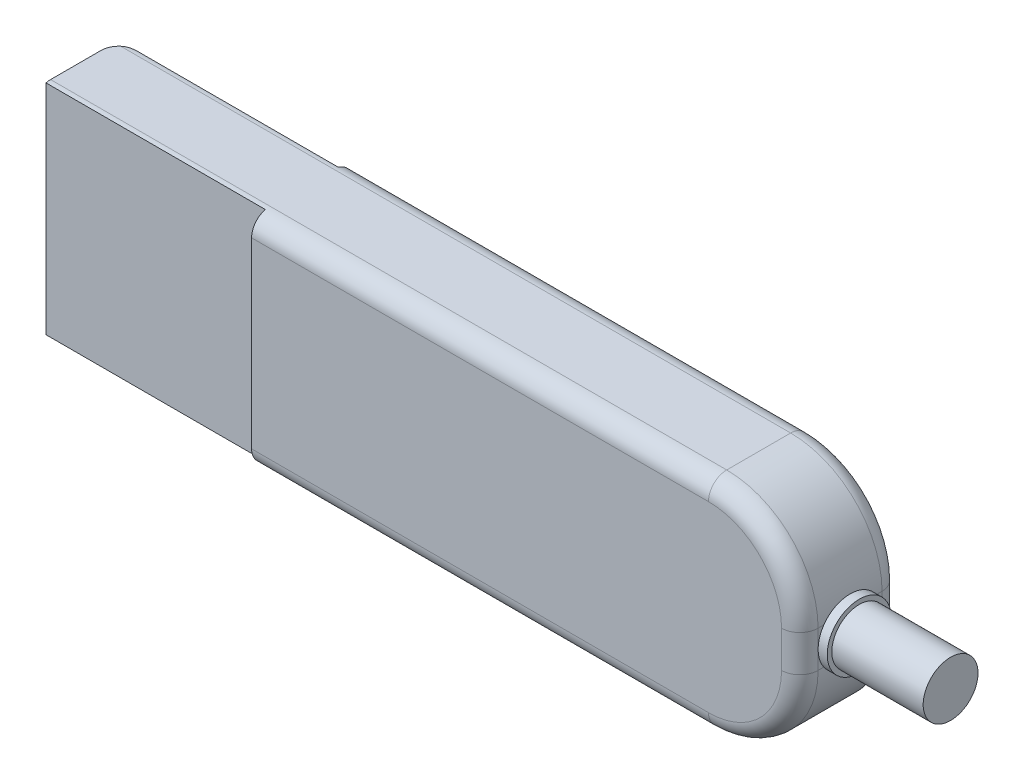
ISO-10303-21;
HEADER;
FILE_DESCRIPTION(('STEP AP214'),'2;1');
FILE_NAME('part.step','',(''),(''),'','','');
FILE_SCHEMA(('AUTOMOTIVE_DESIGN { 1 0 10303 214 1 1 1 1 }'));
ENDSEC;
DATA;
#1=APPLICATION_CONTEXT('core data for automotive mechanical design processes');
#2=APPLICATION_PROTOCOL_DEFINITION('international standard','automotive_design',2000,#1);
#3=PRODUCT_CONTEXT('',#1,'mechanical');
#4=PRODUCT('Part','Part','',(#3));
#5=PRODUCT_RELATED_PRODUCT_CATEGORY('part','',(#4));
#6=PRODUCT_DEFINITION_FORMATION('','',#4);
#7=PRODUCT_DEFINITION_CONTEXT('part definition',#1,'design');
#8=PRODUCT_DEFINITION('design','',#6,#7);
#9=PRODUCT_DEFINITION_SHAPE('','',#8);
#10=(LENGTH_UNIT() NAMED_UNIT(*) SI_UNIT(.MILLI.,.METRE.));
#11=(NAMED_UNIT(*) PLANE_ANGLE_UNIT() SI_UNIT($,.RADIAN.));
#12=(NAMED_UNIT(*) SI_UNIT($,.STERADIAN.) SOLID_ANGLE_UNIT());
#13=UNCERTAINTY_MEASURE_WITH_UNIT(LENGTH_MEASURE(1.E-05),#10,'distance_accuracy_value','');
#14=(GEOMETRIC_REPRESENTATION_CONTEXT(3) GLOBAL_UNCERTAINTY_ASSIGNED_CONTEXT((#13)) GLOBAL_UNIT_ASSIGNED_CONTEXT((#10,
#11,#12)) REPRESENTATION_CONTEXT('',''));
#15=CARTESIAN_POINT('',(0.,0.,0.));
#16=DIRECTION('',(0.,0.,1.));
#17=DIRECTION('',(1.,0.,0.));
#18=AXIS2_PLACEMENT_3D('',#15,#16,#17);
#19=CARTESIAN_POINT('',(30.,0.,5.5));
#20=DIRECTION('',(-1.,0.,0.));
#21=DIRECTION('',(0.,0.,1.));
#22=AXIS2_PLACEMENT_3D('',#19,#20,#21);
#23=PLANE('',#22);
#24=DIRECTION('',(0.,0.,-1.));
#25=VECTOR('',#24,1.);
#26=CARTESIAN_POINT('',(30.,5.00000000000004,5.5));
#27=LINE('',#26,#25);
#28=CARTESIAN_POINT('',(30.,5.00000000000004,1.31385933836547));
#29=VERTEX_POINT('',#28);
#30=CARTESIAN_POINT('',(30.,5.00000000000004,1.));
#31=VERTEX_POINT('',#30);
#32=EDGE_CURVE('E336',#29,#31,#27,.T.);
#33=ORIENTED_EDGE('',*,*,#32,.T.);
#34=DIRECTION('',(0.,1.,0.));
#35=VECTOR('',#34,1.);
#36=CARTESIAN_POINT('',(30.,0.,1.));
#37=LINE('',#36,#35);
#38=CARTESIAN_POINT('',(30.,6.,1.));
#39=VERTEX_POINT('',#38);
#40=EDGE_CURVE('E432',#31,#39,#37,.T.);
#41=ORIENTED_EDGE('',*,*,#40,.T.);
#42=CARTESIAN_POINT('',(30.,6.,2.75));
#43=DIRECTION('',(-1.,0.,0.));
#44=DIRECTION('',(0.,0.,1.));
#45=AXIS2_PLACEMENT_3D('',#42,#43,#44);
#46=CIRCLE('',#45,1.75);
#47=EDGE_CURVE('E352',#29,#39,#46,.F.);
#48=ORIENTED_EDGE('',*,*,#47,.F.);
#49=EDGE_LOOP('',(#33,#41,#48));
#50=FACE_BOUND('',#49,.T.);
#51=ADVANCED_FACE('F34',(#50),#23,.F.);
#52=DIRECTION('',(0.,0.,-1.));
#53=VECTOR('',#52,1.);
#54=CARTESIAN_POINT('',(30.,6.99999999999997,5.5));
#55=LINE('',#54,#53);
#56=CARTESIAN_POINT('',(30.,6.99999999999997,4.5));
#57=VERTEX_POINT('',#56);
#58=CARTESIAN_POINT('',(30.,6.99999999999997,4.18614066163453));
#59=VERTEX_POINT('',#58);
#60=EDGE_CURVE('E334',#57,#59,#55,.T.);
#61=ORIENTED_EDGE('',*,*,#60,.F.);
#62=DIRECTION('',(0.,1.,0.));
#63=VECTOR('',#62,1.);
#64=CARTESIAN_POINT('',(30.,5.00000000000004,4.5));
#65=LINE('',#64,#63);
#66=CARTESIAN_POINT('',(30.,6.,4.5));
#67=VERTEX_POINT('',#66);
#68=EDGE_CURVE('E275',#57,#67,#65,.F.);
#69=ORIENTED_EDGE('',*,*,#68,.T.);
#70=EDGE_CURVE('E348',#59,#67,#46,.F.);
#71=ORIENTED_EDGE('',*,*,#70,.F.);
#72=EDGE_LOOP('',(#61,#69,#71));
#73=FACE_BOUND('',#72,.T.);
#74=ADVANCED_FACE('F406',(#73),#23,.F.);
#75=CARTESIAN_POINT('',(30.5,6.,2.75));
#76=DIRECTION('',(1.,0.,0.));
#77=DIRECTION('',(0.,0.,-1.));
#78=AXIS2_PLACEMENT_3D('',#75,#76,#77);
#79=PLANE('',#78);
#80=CARTESIAN_POINT('',(30.5,6.,2.75));
#81=DIRECTION('',(1.,0.,0.));
#82=DIRECTION('',(0.,0.,-1.));
#83=AXIS2_PLACEMENT_3D('',#80,#81,#82);
#84=CIRCLE('',#83,1.75);
#85=CARTESIAN_POINT('',(30.5,6.,1.));
#86=VERTEX_POINT('',#85);
#87=EDGE_CURVE('E245',#86,#86,#84,.T.);
#88=ORIENTED_EDGE('',*,*,#87,.T.);
#89=EDGE_LOOP('',(#88));
#90=FACE_BOUND('',#89,.T.);
#91=CARTESIAN_POINT('',(30.5,6.,2.75));
#92=DIRECTION('',(1.,0.,0.));
#93=DIRECTION('',(0.,0.,-1.));
#94=AXIS2_PLACEMENT_3D('',#91,#92,#93);
#95=CIRCLE('',#94,1.5);
#96=CARTESIAN_POINT('',(30.5,6.,1.25));
#97=VERTEX_POINT('',#96);
#98=EDGE_CURVE('E241',#97,#97,#95,.T.);
#99=ORIENTED_EDGE('',*,*,#98,.F.);
#100=EDGE_LOOP('',(#99));
#101=FACE_BOUND('',#100,.T.);
#102=ADVANCED_FACE('F483',(#90,#101),#79,.T.);
#103=CARTESIAN_POINT('',(30.,6.99999999999997,1.31385933836547));
#104=VERTEX_POINT('',#103);
#105=EDGE_CURVE('E351',#39,#104,#46,.F.);
#106=ORIENTED_EDGE('',*,*,#105,.F.);
#107=DIRECTION('',(0.,1.,0.));
#108=VECTOR('',#107,1.);
#109=CARTESIAN_POINT('',(30.,0.,1.));
#110=LINE('',#109,#108);
#111=CARTESIAN_POINT('',(30.,6.99999999999997,1.));
#112=VERTEX_POINT('',#111);
#113=EDGE_CURVE('E422',#39,#112,#110,.T.);
#114=ORIENTED_EDGE('',*,*,#113,.T.);
#115=EDGE_CURVE('E331',#104,#112,#55,.T.);
#116=ORIENTED_EDGE('',*,*,#115,.F.);
#117=EDGE_LOOP('',(#106,#114,#116));
#118=FACE_BOUND('',#117,.T.);
#119=ADVANCED_FACE('F421',(#118),#23,.F.);
#120=CARTESIAN_POINT('',(30.,5.00000000000004,4.18614066163453));
#121=VERTEX_POINT('',#120);
#122=EDGE_CURVE('E347',#67,#121,#46,.F.);
#123=ORIENTED_EDGE('',*,*,#122,.F.);
#124=DIRECTION('',(0.,1.,0.));
#125=VECTOR('',#124,1.);
#126=CARTESIAN_POINT('',(30.,5.00000000000004,4.5));
#127=LINE('',#126,#125);
#128=CARTESIAN_POINT('',(30.,5.00000000000004,4.5));
#129=VERTEX_POINT('',#128);
#130=EDGE_CURVE('E273',#67,#129,#127,.F.);
#131=ORIENTED_EDGE('',*,*,#130,.T.);
#132=EDGE_CURVE('E338',#129,#121,#27,.T.);
#133=ORIENTED_EDGE('',*,*,#132,.T.);
#134=EDGE_LOOP('',(#123,#131,#133));
#135=FACE_BOUND('',#134,.T.);
#136=ADVANCED_FACE('F484',(#135),#23,.F.);
#137=CARTESIAN_POINT('',(0.,0.,5.5));
#138=DIRECTION('',(-1.,0.,0.));
#139=DIRECTION('',(0.,0.,1.));
#140=AXIS2_PLACEMENT_3D('',#137,#138,#139);
#141=PLANE('',#140);
#142=DIRECTION('',(0.,1.,0.));
#143=VECTOR('',#142,1.);
#144=CARTESIAN_POINT('',(0.,0.,0.));
#145=LINE('',#144,#143);
#146=CARTESIAN_POINT('',(0.,1.,0.));
#147=VERTEX_POINT('',#146);
#148=CARTESIAN_POINT('',(0.,11.,0.));
#149=VERTEX_POINT('',#148);
#150=EDGE_CURVE('E327',#147,#149,#145,.T.);
#151=ORIENTED_EDGE('',*,*,#150,.F.);
#152=CARTESIAN_POINT('',(0.,1.,1.));
#153=DIRECTION('',(-1.,0.,0.));
#154=DIRECTION('',(0.,0.,1.));
#155=AXIS2_PLACEMENT_3D('',#152,#153,#154);
#156=CIRCLE('',#155,1.);
#157=CARTESIAN_POINT('',(0.,0.0317541634481462,0.75));
#158=VERTEX_POINT('',#157);
#159=EDGE_CURVE('E534',#147,#158,#156,.T.);
#160=ORIENTED_EDGE('',*,*,#159,.T.);
#161=DIRECTION('',(0.,1.,0.));
#162=VECTOR('',#161,1.);
#163=CARTESIAN_POINT('',(0.,12.,0.75));
#164=LINE('',#163,#162);
#165=CARTESIAN_POINT('',(0.,11.9682458365519,0.75));
#166=VERTEX_POINT('',#165);
#167=EDGE_CURVE('E248',#158,#166,#164,.T.);
#168=ORIENTED_EDGE('',*,*,#167,.T.);
#169=CARTESIAN_POINT('',(0.,11.,1.));
#170=DIRECTION('',(-1.,0.,0.));
#171=DIRECTION('',(0.,0.,1.));
#172=AXIS2_PLACEMENT_3D('',#169,#170,#171);
#173=CIRCLE('',#172,1.);
#174=EDGE_CURVE('E315',#166,#149,#173,.T.);
#175=ORIENTED_EDGE('',*,*,#174,.T.);
#176=EDGE_LOOP('',(#151,#160,#168,#175));
#177=FACE_BOUND('',#176,.T.);
#178=ADVANCED_FACE('F493',(#177),#141,.T.);
#179=CARTESIAN_POINT('',(25.,7.,5.5));
#180=DIRECTION('',(0.,0.,-1.));
#181=DIRECTION('',(-1.,0.,0.));
#182=AXIS2_PLACEMENT_3D('',#179,#180,#181);
#183=CYLINDRICAL_SURFACE('',#182,5.);
#184=ORIENTED_EDGE('',*,*,#115,.T.);
#185=CARTESIAN_POINT('',(25.,7.,1.));
#186=DIRECTION('',(0.,0.,1.));
#187=DIRECTION('',(1.,0.,0.));
#188=AXIS2_PLACEMENT_3D('',#185,#186,#187);
#189=CIRCLE('',#188,5.);
#190=CARTESIAN_POINT('',(25.,12.,1.));
#191=VERTEX_POINT('',#190);
#192=EDGE_CURVE('E44',#112,#191,#189,.T.);
#193=ORIENTED_EDGE('',*,*,#192,.T.);
#194=DIRECTION('',(0.,0.,-1.));
#195=VECTOR('',#194,1.);
#196=CARTESIAN_POINT('',(25.,12.,5.5));
#197=LINE('',#196,#195);
#198=CARTESIAN_POINT('',(25.,12.,4.5));
#199=VERTEX_POINT('',#198);
#200=EDGE_CURVE('E345',#199,#191,#197,.T.);
#201=ORIENTED_EDGE('',*,*,#200,.F.);
#202=CARTESIAN_POINT('',(25.,7.,4.5));
#203=DIRECTION('',(0.,0.,1.));
#204=DIRECTION('',(1.,0.,0.));
#205=AXIS2_PLACEMENT_3D('',#202,#203,#204);
#206=CIRCLE('',#205,5.);
#207=EDGE_CURVE('E277',#199,#57,#206,.F.);
#208=ORIENTED_EDGE('',*,*,#207,.T.);
#209=ORIENTED_EDGE('',*,*,#60,.T.);
#210=EDGE_CURVE('E337',#59,#104,#55,.T.);
#211=ORIENTED_EDGE('',*,*,#210,.T.);
#212=EDGE_LOOP('',(#184,#193,#201,#208,#209,#211));
#213=FACE_BOUND('',#212,.T.);
#214=ADVANCED_FACE('F402',(#213),#183,.T.);
#215=CARTESIAN_POINT('',(0.,12.,5.5));
#216=DIRECTION('',(0.,1.,0.));
#217=DIRECTION('',(0.,0.,1.));
#218=AXIS2_PLACEMENT_3D('',#215,#216,#217);
#219=PLANE('',#218);
#220=ORIENTED_EDGE('',*,*,#200,.T.);
#221=DIRECTION('',(1.,0.,0.));
#222=VECTOR('',#221,1.);
#223=CARTESIAN_POINT('',(0.,12.,1.));
#224=LINE('',#223,#222);
#225=CARTESIAN_POINT('',(-11.6614378277661,12.,1.));
#226=VERTEX_POINT('',#225);
#227=EDGE_CURVE('E11',#191,#226,#224,.F.);
#228=ORIENTED_EDGE('',*,*,#227,.T.);
#229=CARTESIAN_POINT('',(-11.,12.,1.75));
#230=DIRECTION('',(0.,1.,0.));
#231=DIRECTION('',(0.,0.,1.));
#232=AXIS2_PLACEMENT_3D('',#229,#230,#231);
#233=CIRCLE('',#232,1.);
#234=CARTESIAN_POINT('',(-12.,12.,1.75));
#235=VERTEX_POINT('',#234);
#236=EDGE_CURVE('E300',#226,#235,#233,.T.);
#237=ORIENTED_EDGE('',*,*,#236,.T.);
#238=DIRECTION('',(0.,0.,-1.));
#239=VECTOR('',#238,1.);
#240=CARTESIAN_POINT('',(-12.,12.,4.75));
#241=LINE('',#240,#239);
#242=CARTESIAN_POINT('',(-12.,12.,4.5));
#243=VERTEX_POINT('',#242);
#244=EDGE_CURVE('E324',#243,#235,#241,.T.);
#245=ORIENTED_EDGE('',*,*,#244,.F.);
#246=DIRECTION('',(1.,0.,0.));
#247=VECTOR('',#246,1.);
#248=CARTESIAN_POINT('',(0.,12.,4.5));
#249=LINE('',#248,#247);
#250=EDGE_CURVE('E279',#243,#199,#249,.T.);
#251=ORIENTED_EDGE('',*,*,#250,.T.);
#252=EDGE_LOOP('',(#220,#228,#237,#245,#251));
#253=FACE_BOUND('',#252,.T.);
#254=ADVANCED_FACE('F733',(#253),#219,.T.);
#255=DIRECTION('',(0.,1.,0.));
#256=VECTOR('',#255,1.);
#257=CARTESIAN_POINT('',(0.,12.,4.75));
#258=LINE('',#257,#256);
#259=CARTESIAN_POINT('',(0.,0.0317541634481459,4.75));
#260=VERTEX_POINT('',#259);
#261=CARTESIAN_POINT('',(0.,11.9682458365519,4.75));
#262=VERTEX_POINT('',#261);
#263=EDGE_CURVE('E257',#260,#262,#258,.T.);
#264=ORIENTED_EDGE('',*,*,#263,.F.);
#265=CARTESIAN_POINT('',(0.,1.,4.5));
#266=DIRECTION('',(-1.,0.,0.));
#267=DIRECTION('',(0.,0.,1.));
#268=AXIS2_PLACEMENT_3D('',#265,#266,#267);
#269=CIRCLE('',#268,1.);
#270=CARTESIAN_POINT('',(0.,1.,5.5));
#271=VERTEX_POINT('',#270);
#272=EDGE_CURVE('E269',#260,#271,#269,.T.);
#273=ORIENTED_EDGE('',*,*,#272,.T.);
#274=DIRECTION('',(0.,1.,0.));
#275=VECTOR('',#274,1.);
#276=CARTESIAN_POINT('',(0.,0.,5.5));
#277=LINE('',#276,#275);
#278=CARTESIAN_POINT('',(0.,11.,5.5));
#279=VERTEX_POINT('',#278);
#280=EDGE_CURVE('E328',#271,#279,#277,.T.);
#281=ORIENTED_EDGE('',*,*,#280,.T.);
#282=CARTESIAN_POINT('',(0.,11.,4.5));
#283=DIRECTION('',(-1.,0.,0.));
#284=DIRECTION('',(0.,0.,1.));
#285=AXIS2_PLACEMENT_3D('',#282,#283,#284);
#286=CIRCLE('',#285,1.);
#287=EDGE_CURVE('E267',#279,#262,#286,.T.);
#288=ORIENTED_EDGE('',*,*,#287,.T.);
#289=EDGE_LOOP('',(#264,#273,#281,#288));
#290=FACE_BOUND('',#289,.T.);
#291=ADVANCED_FACE('F386',(#290),#141,.T.);
#292=CARTESIAN_POINT('',(0.,0.,5.5));
#293=DIRECTION('',(0.,1.,0.));
#294=DIRECTION('',(0.,0.,1.));
#295=AXIS2_PLACEMENT_3D('',#292,#293,#294);
#296=PLANE('',#295);
#297=CARTESIAN_POINT('',(-11.,0.,1.75));
#298=DIRECTION('',(0.,1.,0.));
#299=DIRECTION('',(0.,0.,1.));
#300=AXIS2_PLACEMENT_3D('',#297,#298,#299);
#301=CIRCLE('',#300,1.);
#302=CARTESIAN_POINT('',(-12.,0.,1.75));
#303=VERTEX_POINT('',#302);
#304=CARTESIAN_POINT('',(-11.6614378277661,0.,1.));
#305=VERTEX_POINT('',#304);
#306=EDGE_CURVE('E294',#303,#305,#301,.F.);
#307=ORIENTED_EDGE('',*,*,#306,.T.);
#308=DIRECTION('',(1.,0.,0.));
#309=VECTOR('',#308,1.);
#310=CARTESIAN_POINT('',(0.,0.,1.));
#311=LINE('',#310,#309);
#312=CARTESIAN_POINT('',(25.,0.,1.));
#313=VERTEX_POINT('',#312);
#314=EDGE_CURVE('E302',#305,#313,#311,.T.);
#315=ORIENTED_EDGE('',*,*,#314,.T.);
#316=DIRECTION('',(0.,0.,-1.));
#317=VECTOR('',#316,1.);
#318=CARTESIAN_POINT('',(25.,0.,5.5));
#319=LINE('',#318,#317);
#320=CARTESIAN_POINT('',(25.,0.,4.5));
#321=VERTEX_POINT('',#320);
#322=EDGE_CURVE('E341',#321,#313,#319,.T.);
#323=ORIENTED_EDGE('',*,*,#322,.F.);
#324=DIRECTION('',(1.,0.,0.));
#325=VECTOR('',#324,1.);
#326=CARTESIAN_POINT('',(0.,0.,4.5));
#327=LINE('',#326,#325);
#328=CARTESIAN_POINT('',(-12.,0.,4.5));
#329=VERTEX_POINT('',#328);
#330=EDGE_CURVE('E364',#321,#329,#327,.F.);
#331=ORIENTED_EDGE('',*,*,#330,.T.);
#332=DIRECTION('',(0.,0.,-1.));
#333=VECTOR('',#332,1.);
#334=CARTESIAN_POINT('',(-12.,0.,4.75));
#335=LINE('',#334,#333);
#336=EDGE_CURVE('E321',#329,#303,#335,.T.);
#337=ORIENTED_EDGE('',*,*,#336,.T.);
#338=EDGE_LOOP('',(#307,#315,#323,#331,#337));
#339=FACE_BOUND('',#338,.T.);
#340=ADVANCED_FACE('F539',(#339),#296,.F.);
#341=CARTESIAN_POINT('',(25.,5.,5.5));
#342=DIRECTION('',(0.,0.,-1.));
#343=DIRECTION('',(-1.,0.,0.));
#344=AXIS2_PLACEMENT_3D('',#341,#342,#343);
#345=CYLINDRICAL_SURFACE('',#344,5.);
#346=ORIENTED_EDGE('',*,*,#322,.T.);
#347=CARTESIAN_POINT('',(25.,5.,1.));
#348=DIRECTION('',(0.,0.,1.));
#349=DIRECTION('',(1.,0.,0.));
#350=AXIS2_PLACEMENT_3D('',#347,#348,#349);
#351=CIRCLE('',#350,5.);
#352=EDGE_CURVE('E445',#313,#31,#351,.T.);
#353=ORIENTED_EDGE('',*,*,#352,.T.);
#354=ORIENTED_EDGE('',*,*,#32,.F.);
#355=EDGE_CURVE('E342',#121,#29,#27,.T.);
#356=ORIENTED_EDGE('',*,*,#355,.F.);
#357=ORIENTED_EDGE('',*,*,#132,.F.);
#358=CARTESIAN_POINT('',(25.,5.,4.5));
#359=DIRECTION('',(0.,0.,1.));
#360=DIRECTION('',(1.,0.,0.));
#361=AXIS2_PLACEMENT_3D('',#358,#359,#360);
#362=CIRCLE('',#361,5.);
#363=EDGE_CURVE('E271',#129,#321,#362,.F.);
#364=ORIENTED_EDGE('',*,*,#363,.T.);
#365=EDGE_LOOP('',(#346,#353,#354,#356,#357,#364));
#366=FACE_BOUND('',#365,.T.);
#367=ADVANCED_FACE('F521',(#366),#345,.T.);
#368=CARTESIAN_POINT('',(0.,0.,5.5));
#369=DIRECTION('',(0.,0.,1.));
#370=DIRECTION('',(1.,0.,0.));
#371=AXIS2_PLACEMENT_3D('',#368,#369,#370);
#372=PLANE('',#371);
#373=ORIENTED_EDGE('',*,*,#280,.F.);
#374=DIRECTION('',(1.,0.,0.));
#375=VECTOR('',#374,1.);
#376=CARTESIAN_POINT('',(25.,1.,5.5));
#377=LINE('',#376,#375);
#378=CARTESIAN_POINT('',(25.,1.,5.5));
#379=VERTEX_POINT('',#378);
#380=EDGE_CURVE('E361',#271,#379,#377,.T.);
#381=ORIENTED_EDGE('',*,*,#380,.T.);
#382=CARTESIAN_POINT('',(25.,5.,5.5));
#383=DIRECTION('',(0.,0.,1.));
#384=DIRECTION('',(1.,0.,0.));
#385=AXIS2_PLACEMENT_3D('',#382,#383,#384);
#386=CIRCLE('',#385,4.);
#387=CARTESIAN_POINT('',(29.,5.00000000000003,5.5));
#388=VERTEX_POINT('',#387);
#389=EDGE_CURVE('E359',#379,#388,#386,.T.);
#390=ORIENTED_EDGE('',*,*,#389,.T.);
#391=DIRECTION('',(0.,1.,0.));
#392=VECTOR('',#391,1.);
#393=CARTESIAN_POINT('',(29.,6.99999999999997,5.5));
#394=LINE('',#393,#392);
#395=CARTESIAN_POINT('',(29.,6.99999999999997,5.5));
#396=VERTEX_POINT('',#395);
#397=EDGE_CURVE('E357',#388,#396,#394,.T.);
#398=ORIENTED_EDGE('',*,*,#397,.T.);
#399=CARTESIAN_POINT('',(25.,7.,5.5));
#400=DIRECTION('',(0.,0.,1.));
#401=DIRECTION('',(1.,0.,0.));
#402=AXIS2_PLACEMENT_3D('',#399,#400,#401);
#403=CIRCLE('',#402,4.);
#404=CARTESIAN_POINT('',(25.,11.,5.5));
#405=VERTEX_POINT('',#404);
#406=EDGE_CURVE('E355',#396,#405,#403,.T.);
#407=ORIENTED_EDGE('',*,*,#406,.T.);
#408=DIRECTION('',(1.,0.,0.));
#409=VECTOR('',#408,1.);
#410=CARTESIAN_POINT('',(0.,11.,5.5));
#411=LINE('',#410,#409);
#412=EDGE_CURVE('E353',#405,#279,#411,.F.);
#413=ORIENTED_EDGE('',*,*,#412,.T.);
#414=EDGE_LOOP('',(#373,#381,#390,#398,#407,#413));
#415=FACE_BOUND('',#414,.T.);
#416=ADVANCED_FACE('F389',(#415),#372,.T.);
#417=CARTESIAN_POINT('',(0.,0.,0.));
#418=DIRECTION('',(0.,0.,1.));
#419=DIRECTION('',(1.,0.,0.));
#420=AXIS2_PLACEMENT_3D('',#417,#418,#419);
#421=PLANE('',#420);
#422=CARTESIAN_POINT('',(25.,5.,0.));
#423=DIRECTION('',(0.,0.,1.));
#424=DIRECTION('',(1.,0.,0.));
#425=AXIS2_PLACEMENT_3D('',#422,#423,#424);
#426=CIRCLE('',#425,4.);
#427=CARTESIAN_POINT('',(29.,5.00000000000003,0.));
#428=VERTEX_POINT('',#427);
#429=CARTESIAN_POINT('',(25.,1.,0.));
#430=VERTEX_POINT('',#429);
#431=EDGE_CURVE('E311',#428,#430,#426,.F.);
#432=ORIENTED_EDGE('',*,*,#431,.T.);
#433=DIRECTION('',(1.,0.,0.));
#434=VECTOR('',#433,1.);
#435=CARTESIAN_POINT('',(0.,1.,0.));
#436=LINE('',#435,#434);
#437=EDGE_CURVE('E313',#430,#147,#436,.F.);
#438=ORIENTED_EDGE('',*,*,#437,.T.);
#439=ORIENTED_EDGE('',*,*,#150,.T.);
#440=DIRECTION('',(1.,0.,0.));
#441=VECTOR('',#440,1.);
#442=CARTESIAN_POINT('',(25.,11.,0.));
#443=LINE('',#442,#441);
#444=CARTESIAN_POINT('',(25.,11.,0.));
#445=VERTEX_POINT('',#444);
#446=EDGE_CURVE('E305',#149,#445,#443,.T.);
#447=ORIENTED_EDGE('',*,*,#446,.T.);
#448=CARTESIAN_POINT('',(25.,7.,0.));
#449=DIRECTION('',(0.,0.,1.));
#450=DIRECTION('',(1.,0.,0.));
#451=AXIS2_PLACEMENT_3D('',#448,#449,#450);
#452=CIRCLE('',#451,4.);
#453=CARTESIAN_POINT('',(29.,6.99999999999997,0.));
#454=VERTEX_POINT('',#453);
#455=EDGE_CURVE('E307',#445,#454,#452,.F.);
#456=ORIENTED_EDGE('',*,*,#455,.T.);
#457=DIRECTION('',(0.,1.,0.));
#458=VECTOR('',#457,1.);
#459=CARTESIAN_POINT('',(29.,0.,0.));
#460=LINE('',#459,#458);
#461=EDGE_CURVE('E309',#454,#428,#460,.F.);
#462=ORIENTED_EDGE('',*,*,#461,.T.);
#463=EDGE_LOOP('',(#432,#438,#439,#447,#456,#462));
#464=FACE_BOUND('',#463,.T.);
#465=ADVANCED_FACE('F518',(#464),#421,.F.);
#466=CARTESIAN_POINT('',(-12.,12.,4.75));
#467=DIRECTION('',(1.,0.,0.));
#468=DIRECTION('',(0.,1.,0.));
#469=AXIS2_PLACEMENT_3D('',#466,#467,#468);
#470=PLANE('',#469);
#471=DIRECTION('',(0.,0.,1.));
#472=VECTOR('',#471,1.);
#473=CARTESIAN_POINT('',(-12.,0.249999999999998,2.25));
#474=LINE('',#473,#472);
#475=CARTESIAN_POINT('',(-12.,0.249999999999999,2.25));
#476=VERTEX_POINT('',#475);
#477=CARTESIAN_POINT('',(-12.,0.249999999999998,4.25));
#478=VERTEX_POINT('',#477);
#479=EDGE_CURVE('E227',#476,#478,#474,.T.);
#480=ORIENTED_EDGE('',*,*,#479,.F.);
#481=DIRECTION('',(0.,-1.,0.));
#482=VECTOR('',#481,1.);
#483=CARTESIAN_POINT('',(-12.,11.75,2.25));
#484=LINE('',#483,#482);
#485=CARTESIAN_POINT('',(-12.,11.75,2.25));
#486=VERTEX_POINT('',#485);
#487=EDGE_CURVE('E52',#486,#476,#484,.T.);
#488=ORIENTED_EDGE('',*,*,#487,.F.);
#489=DIRECTION('',(0.,0.,-1.));
#490=VECTOR('',#489,1.);
#491=CARTESIAN_POINT('',(-12.,11.75,2.25));
#492=LINE('',#491,#490);
#493=CARTESIAN_POINT('',(-12.,11.75,4.25));
#494=VERTEX_POINT('',#493);
#495=EDGE_CURVE('E218',#494,#486,#492,.T.);
#496=ORIENTED_EDGE('',*,*,#495,.F.);
#497=DIRECTION('',(0.,1.,0.));
#498=VECTOR('',#497,1.);
#499=CARTESIAN_POINT('',(-12.,11.75,4.25));
#500=LINE('',#499,#498);
#501=EDGE_CURVE('E221',#478,#494,#500,.T.);
#502=ORIENTED_EDGE('',*,*,#501,.F.);
#503=EDGE_LOOP('',(#480,#488,#496,#502));
#504=FACE_BOUND('',#503,.T.);
#505=ORIENTED_EDGE('',*,*,#244,.T.);
#506=DIRECTION('',(0.,-1.,0.));
#507=VECTOR('',#506,1.);
#508=CARTESIAN_POINT('',(-12.,0.,1.75));
#509=LINE('',#508,#507);
#510=EDGE_CURVE('E281',#235,#303,#509,.T.);
#511=ORIENTED_EDGE('',*,*,#510,.T.);
#512=ORIENTED_EDGE('',*,*,#336,.F.);
#513=CARTESIAN_POINT('',(-12.,1.,4.5));
#514=DIRECTION('',(1.,0.,0.));
#515=DIRECTION('',(0.,1.,0.));
#516=AXIS2_PLACEMENT_3D('',#513,#514,#515);
#517=CIRCLE('',#516,1.);
#518=CARTESIAN_POINT('',(-12.,0.0317541634481458,4.75));
#519=VERTEX_POINT('',#518);
#520=EDGE_CURVE('E261',#329,#519,#517,.F.);
#521=ORIENTED_EDGE('',*,*,#520,.T.);
#522=DIRECTION('',(0.,-1.,0.));
#523=VECTOR('',#522,1.);
#524=CARTESIAN_POINT('',(-12.,12.,4.75));
#525=LINE('',#524,#523);
#526=CARTESIAN_POINT('',(-12.,11.9682458365519,4.75));
#527=VERTEX_POINT('',#526);
#528=EDGE_CURVE('E254',#527,#519,#525,.T.);
#529=ORIENTED_EDGE('',*,*,#528,.F.);
#530=CARTESIAN_POINT('',(-12.,11.,4.5));
#531=DIRECTION('',(1.,0.,0.));
#532=DIRECTION('',(0.,1.,0.));
#533=AXIS2_PLACEMENT_3D('',#530,#531,#532);
#534=CIRCLE('',#533,1.);
#535=EDGE_CURVE('E365',#527,#243,#534,.F.);
#536=ORIENTED_EDGE('',*,*,#535,.T.);
#537=EDGE_LOOP('',(#505,#511,#512,#521,#529,#536));
#538=FACE_BOUND('',#537,.T.);
#539=ADVANCED_FACE('F373',(#504,#538),#470,.F.);
#540=CARTESIAN_POINT('',(0.,0.,4.75));
#541=DIRECTION('',(0.,0.,-1.));
#542=DIRECTION('',(-1.,0.,0.));
#543=AXIS2_PLACEMENT_3D('',#540,#541,#542);
#544=PLANE('',#543);
#545=ORIENTED_EDGE('',*,*,#528,.T.);
#546=DIRECTION('',(-1.,0.,0.));
#547=VECTOR('',#546,1.);
#548=CARTESIAN_POINT('',(-12.,0.031754163448145,4.75));
#549=LINE('',#548,#547);
#550=EDGE_CURVE('E265',#519,#260,#549,.F.);
#551=ORIENTED_EDGE('',*,*,#550,.T.);
#552=ORIENTED_EDGE('',*,*,#263,.T.);
#553=DIRECTION('',(1.,0.,0.));
#554=VECTOR('',#553,1.);
#555=CARTESIAN_POINT('',(0.,11.9682458365519,4.75));
#556=LINE('',#555,#554);
#557=EDGE_CURVE('E263',#262,#527,#556,.F.);
#558=ORIENTED_EDGE('',*,*,#557,.T.);
#559=EDGE_LOOP('',(#545,#551,#552,#558));
#560=FACE_BOUND('',#559,.T.);
#561=ADVANCED_FACE('F378',(#560),#544,.F.);
#562=CARTESIAN_POINT('',(0.,0.,0.75));
#563=DIRECTION('',(0.,0.,-1.));
#564=DIRECTION('',(-1.,0.,0.));
#565=AXIS2_PLACEMENT_3D('',#562,#563,#564);
#566=PLANE('',#565);
#567=ORIENTED_EDGE('',*,*,#167,.F.);
#568=DIRECTION('',(1.,0.,0.));
#569=VECTOR('',#568,1.);
#570=CARTESIAN_POINT('',(0.,0.0317541634481467,0.75));
#571=LINE('',#570,#569);
#572=CARTESIAN_POINT('',(-11.,0.0317541634481449,0.75));
#573=VERTEX_POINT('',#572);
#574=EDGE_CURVE('E832',#158,#573,#571,.F.);
#575=ORIENTED_EDGE('',*,*,#574,.T.);
#576=DIRECTION('',(0.,-1.,0.));
#577=VECTOR('',#576,1.);
#578=CARTESIAN_POINT('',(-11.,12.,0.75));
#579=LINE('',#578,#577);
#580=CARTESIAN_POINT('',(-11.,11.9682458365519,0.75));
#581=VERTEX_POINT('',#580);
#582=EDGE_CURVE('E297',#573,#581,#579,.F.);
#583=ORIENTED_EDGE('',*,*,#582,.T.);
#584=DIRECTION('',(-1.,0.,0.));
#585=VECTOR('',#584,1.);
#586=CARTESIAN_POINT('',(-11.,11.9682458365519,0.75));
#587=LINE('',#586,#585);
#588=EDGE_CURVE('E833',#581,#166,#587,.F.);
#589=ORIENTED_EDGE('',*,*,#588,.T.);
#590=EDGE_LOOP('',(#567,#575,#583,#589));
#591=FACE_BOUND('',#590,.T.);
#592=ADVANCED_FACE('F507',(#591),#566,.T.);
#593=CARTESIAN_POINT('',(30.,6.,2.75));
#594=DIRECTION('',(1.,0.,0.));
#595=DIRECTION('',(0.,0.,-1.));
#596=AXIS2_PLACEMENT_3D('',#593,#594,#595);
#597=PLANE('',#596);
#598=CARTESIAN_POINT('',(30.,6.,2.75));
#599=DIRECTION('',(1.,0.,0.));
#600=DIRECTION('',(0.,0.,-1.));
#601=AXIS2_PLACEMENT_3D('',#598,#599,#600);
#602=CIRCLE('',#601,1.75);
#603=EDGE_CURVE('E249',#104,#59,#602,.T.);
#604=ORIENTED_EDGE('',*,*,#603,.F.);
#605=ORIENTED_EDGE('',*,*,#210,.F.);
#606=EDGE_LOOP('',(#604,#605));
#607=FACE_BOUND('',#606,.T.);
#608=ADVANCED_FACE('F413',(#607),#597,.F.);
#609=EDGE_CURVE('E240',#121,#29,#602,.T.);
#610=ORIENTED_EDGE('',*,*,#609,.F.);
#611=ORIENTED_EDGE('',*,*,#355,.T.);
#612=EDGE_LOOP('',(#610,#611));
#613=FACE_BOUND('',#612,.T.);
#614=ADVANCED_FACE('F506',(#613),#597,.F.);
#615=CARTESIAN_POINT('',(30.5,6.,2.75));
#616=DIRECTION('',(-1.,0.,0.));
#617=DIRECTION('',(0.,0.,1.));
#618=AXIS2_PLACEMENT_3D('',#615,#616,#617);
#619=CYLINDRICAL_SURFACE('',#618,1.75);
#620=ORIENTED_EDGE('',*,*,#87,.F.);
#621=EDGE_LOOP('',(#620));
#622=FACE_BOUND('',#621,.T.);
#623=ORIENTED_EDGE('',*,*,#603,.T.);
#624=ORIENTED_EDGE('',*,*,#70,.T.);
#625=ORIENTED_EDGE('',*,*,#122,.T.);
#626=ORIENTED_EDGE('',*,*,#609,.T.);
#627=ORIENTED_EDGE('',*,*,#47,.T.);
#628=ORIENTED_EDGE('',*,*,#105,.T.);
#629=EDGE_LOOP('',(#623,#624,#625,#626,#627,#628));
#630=FACE_BOUND('',#629,.T.);
#631=ADVANCED_FACE('F414',(#622,#630),#619,.T.);
#632=CARTESIAN_POINT('',(35.5,6.,2.75));
#633=DIRECTION('',(-1.,0.,0.));
#634=DIRECTION('',(0.,0.,1.));
#635=AXIS2_PLACEMENT_3D('',#632,#633,#634);
#636=CYLINDRICAL_SURFACE('',#635,1.5);
#637=CARTESIAN_POINT('',(35.5,6.,2.75));
#638=DIRECTION('',(1.,0.,0.));
#639=DIRECTION('',(0.,0.,-1.));
#640=AXIS2_PLACEMENT_3D('',#637,#638,#639);
#641=CIRCLE('',#640,1.5);
#642=CARTESIAN_POINT('',(35.5,6.,1.25));
#643=VERTEX_POINT('',#642);
#644=EDGE_CURVE('E237',#643,#643,#641,.T.);
#645=ORIENTED_EDGE('',*,*,#644,.F.);
#646=EDGE_LOOP('',(#645));
#647=FACE_BOUND('',#646,.T.);
#648=ORIENTED_EDGE('',*,*,#98,.T.);
#649=EDGE_LOOP('',(#648));
#650=FACE_BOUND('',#649,.T.);
#651=ADVANCED_FACE('F502',(#647,#650),#636,.T.);
#652=CARTESIAN_POINT('',(35.5,6.,2.75));
#653=DIRECTION('',(1.,0.,0.));
#654=DIRECTION('',(0.,0.,-1.));
#655=AXIS2_PLACEMENT_3D('',#652,#653,#654);
#656=PLANE('',#655);
#657=ORIENTED_EDGE('',*,*,#644,.T.);
#658=EDGE_LOOP('',(#657));
#659=FACE_BOUND('',#658,.T.);
#660=ADVANCED_FACE('F572',(#659),#656,.T.);
#661=CARTESIAN_POINT('',(0.,11.,4.5));
#662=DIRECTION('',(1.,0.,0.));
#663=DIRECTION('',(0.,0.,-1.));
#664=AXIS2_PLACEMENT_3D('',#661,#662,#663);
#665=CYLINDRICAL_SURFACE('',#664,1.);
#666=ORIENTED_EDGE('',*,*,#287,.F.);
#667=ORIENTED_EDGE('',*,*,#412,.F.);
#668=CARTESIAN_POINT('',(25.,11.,4.5));
#669=DIRECTION('',(1.,0.,0.));
#670=DIRECTION('',(0.,0.,-1.));
#671=AXIS2_PLACEMENT_3D('',#668,#669,#670);
#672=CIRCLE('',#671,1.);
#673=EDGE_CURVE('E244',#199,#405,#672,.T.);
#674=ORIENTED_EDGE('',*,*,#673,.F.);
#675=ORIENTED_EDGE('',*,*,#250,.F.);
#676=ORIENTED_EDGE('',*,*,#535,.F.);
#677=ORIENTED_EDGE('',*,*,#557,.F.);
#678=EDGE_LOOP('',(#666,#667,#674,#675,#676,#677));
#679=FACE_BOUND('',#678,.T.);
#680=ADVANCED_FACE('F394',(#679),#665,.T.);
#681=CARTESIAN_POINT('',(25.,7.,4.5));
#682=DIRECTION('',(0.,0.,1.));
#683=DIRECTION('',(1.,0.,0.));
#684=AXIS2_PLACEMENT_3D('',#681,#682,#683);
#685=TOROIDAL_SURFACE('',#684,4.,1.);
#686=ORIENTED_EDGE('',*,*,#673,.T.);
#687=ORIENTED_EDGE('',*,*,#406,.F.);
#688=CARTESIAN_POINT('',(29.,6.99999999999997,4.5));
#689=DIRECTION('',(0.,-1.,0.));
#690=DIRECTION('',(0.,0.,-1.));
#691=AXIS2_PLACEMENT_3D('',#688,#689,#690);
#692=CIRCLE('',#691,1.);
#693=EDGE_CURVE('E287',#57,#396,#692,.T.);
#694=ORIENTED_EDGE('',*,*,#693,.F.);
#695=ORIENTED_EDGE('',*,*,#207,.F.);
#696=EDGE_LOOP('',(#686,#687,#694,#695));
#697=FACE_BOUND('',#696,.T.);
#698=ADVANCED_FACE('F398',(#697),#685,.T.);
#699=CARTESIAN_POINT('',(29.,0.,4.5));
#700=DIRECTION('',(0.,-1.,0.));
#701=DIRECTION('',(0.,0.,-1.));
#702=AXIS2_PLACEMENT_3D('',#699,#700,#701);
#703=CYLINDRICAL_SURFACE('',#702,1.);
#704=ORIENTED_EDGE('',*,*,#693,.T.);
#705=ORIENTED_EDGE('',*,*,#397,.F.);
#706=CARTESIAN_POINT('',(29.,5.00000000000004,4.5));
#707=DIRECTION('',(0.,-1.,0.));
#708=DIRECTION('',(0.,0.,-1.));
#709=AXIS2_PLACEMENT_3D('',#706,#707,#708);
#710=CIRCLE('',#709,1.);
#711=EDGE_CURVE('E284',#129,#388,#710,.T.);
#712=ORIENTED_EDGE('',*,*,#711,.F.);
#713=ORIENTED_EDGE('',*,*,#130,.F.);
#714=ORIENTED_EDGE('',*,*,#68,.F.);
#715=EDGE_LOOP('',(#704,#705,#712,#713,#714));
#716=FACE_BOUND('',#715,.T.);
#717=ADVANCED_FACE('F551',(#716),#703,.T.);
#718=CARTESIAN_POINT('',(25.,5.,4.5));
#719=DIRECTION('',(0.,0.,1.));
#720=DIRECTION('',(1.,0.,0.));
#721=AXIS2_PLACEMENT_3D('',#718,#719,#720);
#722=TOROIDAL_SURFACE('',#721,4.,1.);
#723=ORIENTED_EDGE('',*,*,#711,.T.);
#724=ORIENTED_EDGE('',*,*,#389,.F.);
#725=CARTESIAN_POINT('',(25.,1.,4.5));
#726=DIRECTION('',(-1.,0.,0.));
#727=DIRECTION('',(0.,0.,1.));
#728=AXIS2_PLACEMENT_3D('',#725,#726,#727);
#729=CIRCLE('',#728,1.);
#730=EDGE_CURVE('E282',#321,#379,#729,.T.);
#731=ORIENTED_EDGE('',*,*,#730,.F.);
#732=ORIENTED_EDGE('',*,*,#363,.F.);
#733=EDGE_LOOP('',(#723,#724,#731,#732));
#734=FACE_BOUND('',#733,.T.);
#735=ADVANCED_FACE('F547',(#734),#722,.T.);
#736=CARTESIAN_POINT('',(0.,1.,4.5));
#737=DIRECTION('',(-1.,0.,0.));
#738=DIRECTION('',(0.,0.,1.));
#739=AXIS2_PLACEMENT_3D('',#736,#737,#738);
#740=CYLINDRICAL_SURFACE('',#739,1.);
#741=ORIENTED_EDGE('',*,*,#520,.F.);
#742=ORIENTED_EDGE('',*,*,#330,.F.);
#743=ORIENTED_EDGE('',*,*,#730,.T.);
#744=ORIENTED_EDGE('',*,*,#380,.F.);
#745=ORIENTED_EDGE('',*,*,#272,.F.);
#746=ORIENTED_EDGE('',*,*,#550,.F.);
#747=EDGE_LOOP('',(#741,#742,#743,#744,#745,#746));
#748=FACE_BOUND('',#747,.T.);
#749=ADVANCED_FACE('F382',(#748),#740,.T.);
#750=CARTESIAN_POINT('',(-11.,12.,1.75));
#751=DIRECTION('',(0.,1.,0.));
#752=DIRECTION('',(-1.,0.,0.));
#753=AXIS2_PLACEMENT_3D('',#750,#751,#752);
#754=CYLINDRICAL_SURFACE('',#753,1.);
#755=ORIENTED_EDGE('',*,*,#582,.F.);
#756=CARTESIAN_POINT('',(-11.,0.0317541634481449,0.75));
#757=CARTESIAN_POINT('',(-11.0279157361146,0.0317642898679042,0.749996739632083));
#758=CARTESIAN_POINT('',(-11.0558285400231,0.0314525721656708,0.751168838736714));
#759=CARTESIAN_POINT('',(-11.1114397456205,0.0302600782818986,0.755838105186));
#760=CARTESIAN_POINT('',(-11.139138201487,0.0293794509879831,0.759334664210168));
#761=CARTESIAN_POINT('',(-11.1941736161564,0.0271217822988996,0.768635103918343));
#762=CARTESIAN_POINT('',(-11.2215098822484,0.0257439015839071,0.774442887457889));
#763=CARTESIAN_POINT('',(-11.2755761318431,0.0226363413507741,0.788315389209761));
#764=CARTESIAN_POINT('',(-11.3023061062304,0.0209066565472589,0.796380141330635));
#765=CARTESIAN_POINT('',(-11.3813115848923,0.0154522664181573,0.82387523746504));
#766=CARTESIAN_POINT('',(-11.4324543031258,0.0114595165732288,0.846615225313142));
#767=CARTESIAN_POINT('',(-11.5301488769641,0.0046213074520643,0.900274629249468));
#768=CARTESIAN_POINT('',(-11.5767153218949,0.00177210654057304,0.931166812590121));
#769=CARTESIAN_POINT('',(-11.6343708552383,0.000209208219844479,0.976763157581296));
#770=CARTESIAN_POINT('',(-11.6480649781608,9.58966598153783E-07,0.988202458563566));
#771=CARTESIAN_POINT('',(-11.6614378277661,0.,1.));
#772=B_SPLINE_CURVE_WITH_KNOTS('',3,(#756,#757,#758,#759,#760,#761,#762,#763,#764,#765,#766,
#767,#768,#769,#770,#771),.UNSPECIFIED.,.F.,.F.,(4,2,2,2,2,2,2,4),(0.,0.0837159542764262,
0.167410008372025,0.251245996483438,0.335083244208835,0.50260231442727,0.66956871257712,
0.723074486451575),.UNSPECIFIED.);
#773=EDGE_CURVE('E447',#573,#305,#772,.T.);
#774=ORIENTED_EDGE('',*,*,#773,.T.);
#775=ORIENTED_EDGE('',*,*,#306,.F.);
#776=ORIENTED_EDGE('',*,*,#510,.F.);
#777=ORIENTED_EDGE('',*,*,#236,.F.);
#778=CARTESIAN_POINT('',(-11.6614378277661,12.,1.));
#779=CARTESIAN_POINT('',(-11.6405070408053,11.9999984301769,0.981540368961976));
#780=CARTESIAN_POINT('',(-11.6188193251789,11.9994892837099,0.963972502072734));
#781=CARTESIAN_POINT('',(-11.5740815679091,11.997736780582,0.930727694452248));
#782=CARTESIAN_POINT('',(-11.5510321436775,11.9964937544045,0.915049906397846));
#783=CARTESIAN_POINT('',(-11.4799799380301,11.9920803444812,0.870952157918971));
#784=CARTESIAN_POINT('',(-11.4301261797022,11.9882270324753,0.845514399180074));
#785=CARTESIAN_POINT('',(-11.3269259581176,11.9806995080365,0.803304341229124));
#786=CARTESIAN_POINT('',(-11.2735809151198,11.977025223823,0.786528542707137));
#787=CARTESIAN_POINT('',(-11.1648754878091,11.9713806901262,0.762124209089813));
#788=CARTESIAN_POINT('',(-11.109522095404,11.9694050278078,0.754466587722088));
#789=CARTESIAN_POINT('',(-11.0359878185716,11.968367181969,0.750483384805811));
#790=CARTESIAN_POINT('',(-11.0179896226671,11.968238213659,0.74999627590924));
#791=CARTESIAN_POINT('',(-11.,11.9682458365519,0.75));
#792=B_SPLINE_CURVE_WITH_KNOTS('',3,(#778,#779,#780,#781,#782,#783,#784,#785,#786,#787,#788,
#789,#790,#791),.UNSPECIFIED.,.F.,.F.,(4,2,2,2,2,2,4),(0.,0.0836561074667881,0.167274571296701,
0.334720341595264,0.502098413129901,0.668941118987524,0.722926741747065),.UNSPECIFIED.);
#793=EDGE_CURVE('E454',#226,#581,#792,.T.);
#794=ORIENTED_EDGE('',*,*,#793,.T.);
#795=EDGE_LOOP('',(#755,#774,#775,#776,#777,#794));
#796=FACE_BOUND('',#795,.T.);
#797=ADVANCED_FACE('F459',(#796),#754,.T.);
#798=CARTESIAN_POINT('',(0.,11.,1.));
#799=DIRECTION('',(-1.,0.,0.));
#800=DIRECTION('',(0.,0.,1.));
#801=AXIS2_PLACEMENT_3D('',#798,#799,#800);
#802=CYLINDRICAL_SURFACE('',#801,1.);
#803=ORIENTED_EDGE('',*,*,#793,.F.);
#804=ORIENTED_EDGE('',*,*,#227,.F.);
#805=CARTESIAN_POINT('',(25.,11.,1.));
#806=DIRECTION('',(1.,0.,0.));
#807=DIRECTION('',(0.,1.,0.));
#808=AXIS2_PLACEMENT_3D('',#805,#806,#807);
#809=CIRCLE('',#808,1.);
#810=EDGE_CURVE('E39',#445,#191,#809,.T.);
#811=ORIENTED_EDGE('',*,*,#810,.F.);
#812=ORIENTED_EDGE('',*,*,#446,.F.);
#813=ORIENTED_EDGE('',*,*,#174,.F.);
#814=ORIENTED_EDGE('',*,*,#588,.F.);
#815=EDGE_LOOP('',(#803,#804,#811,#812,#813,#814));
#816=FACE_BOUND('',#815,.T.);
#817=ADVANCED_FACE('F36',(#816),#802,.T.);
#818=CARTESIAN_POINT('',(25.,7.,1.));
#819=DIRECTION('',(0.,0.,1.));
#820=DIRECTION('',(1.,0.,0.));
#821=AXIS2_PLACEMENT_3D('',#818,#819,#820);
#822=TOROIDAL_SURFACE('',#821,4.,1.);
#823=ORIENTED_EDGE('',*,*,#810,.T.);
#824=ORIENTED_EDGE('',*,*,#192,.F.);
#825=CARTESIAN_POINT('',(29.,6.99999999999997,1.));
#826=DIRECTION('',(0.,-1.,0.));
#827=DIRECTION('',(0.,0.,-1.));
#828=AXIS2_PLACEMENT_3D('',#825,#826,#827);
#829=CIRCLE('',#828,1.);
#830=EDGE_CURVE('E429',#454,#112,#829,.T.);
#831=ORIENTED_EDGE('',*,*,#830,.F.);
#832=ORIENTED_EDGE('',*,*,#455,.F.);
#833=EDGE_LOOP('',(#823,#824,#831,#832));
#834=FACE_BOUND('',#833,.T.);
#835=ADVANCED_FACE('F427',(#834),#822,.T.);
#836=CARTESIAN_POINT('',(29.,0.,1.));
#837=DIRECTION('',(0.,1.,0.));
#838=DIRECTION('',(0.,0.,1.));
#839=AXIS2_PLACEMENT_3D('',#836,#837,#838);
#840=CYLINDRICAL_SURFACE('',#839,1.);
#841=ORIENTED_EDGE('',*,*,#113,.F.);
#842=ORIENTED_EDGE('',*,*,#40,.F.);
#843=CARTESIAN_POINT('',(29.,5.00000000000003,1.));
#844=DIRECTION('',(0.,-1.,0.));
#845=DIRECTION('',(1.,0.,0.));
#846=AXIS2_PLACEMENT_3D('',#843,#844,#845);
#847=CIRCLE('',#846,1.);
#848=EDGE_CURVE('E438',#428,#31,#847,.T.);
#849=ORIENTED_EDGE('',*,*,#848,.F.);
#850=ORIENTED_EDGE('',*,*,#461,.F.);
#851=ORIENTED_EDGE('',*,*,#830,.T.);
#852=EDGE_LOOP('',(#841,#842,#849,#850,#851));
#853=FACE_BOUND('',#852,.T.);
#854=ADVANCED_FACE('F435',(#853),#840,.T.);
#855=CARTESIAN_POINT('',(25.,5.,1.));
#856=DIRECTION('',(0.,0.,1.));
#857=DIRECTION('',(1.,0.,0.));
#858=AXIS2_PLACEMENT_3D('',#855,#856,#857);
#859=TOROIDAL_SURFACE('',#858,4.,1.);
#860=ORIENTED_EDGE('',*,*,#848,.T.);
#861=ORIENTED_EDGE('',*,*,#352,.F.);
#862=CARTESIAN_POINT('',(25.,1.,1.));
#863=DIRECTION('',(-1.,0.,0.));
#864=DIRECTION('',(0.,0.,1.));
#865=AXIS2_PLACEMENT_3D('',#862,#863,#864);
#866=CIRCLE('',#865,1.);
#867=EDGE_CURVE('E233',#430,#313,#866,.T.);
#868=ORIENTED_EDGE('',*,*,#867,.F.);
#869=ORIENTED_EDGE('',*,*,#431,.F.);
#870=EDGE_LOOP('',(#860,#861,#868,#869));
#871=FACE_BOUND('',#870,.T.);
#872=ADVANCED_FACE('F466',(#871),#859,.T.);
#873=CARTESIAN_POINT('',(0.,1.,1.));
#874=DIRECTION('',(1.,0.,0.));
#875=DIRECTION('',(0.,0.,-1.));
#876=AXIS2_PLACEMENT_3D('',#873,#874,#875);
#877=CYLINDRICAL_SURFACE('',#876,1.);
#878=ORIENTED_EDGE('',*,*,#159,.F.);
#879=ORIENTED_EDGE('',*,*,#437,.F.);
#880=ORIENTED_EDGE('',*,*,#867,.T.);
#881=ORIENTED_EDGE('',*,*,#314,.F.);
#882=ORIENTED_EDGE('',*,*,#773,.F.);
#883=ORIENTED_EDGE('',*,*,#574,.F.);
#884=EDGE_LOOP('',(#878,#879,#880,#881,#882,#883));
#885=FACE_BOUND('',#884,.T.);
#886=ADVANCED_FACE('F462',(#885),#877,.T.);
#887=CARTESIAN_POINT('',(0.,11.75,2.25));
#888=DIRECTION('',(0.,0.,-1.));
#889=DIRECTION('',(0.,1.,0.));
#890=AXIS2_PLACEMENT_3D('',#887,#888,#889);
#891=PLANE('',#890);
#892=ORIENTED_EDGE('',*,*,#487,.T.);
#893=DIRECTION('',(-1.,0.,0.));
#894=VECTOR('',#893,1.);
#895=CARTESIAN_POINT('',(0.,0.250000000000002,2.25));
#896=LINE('',#895,#894);
#897=CARTESIAN_POINT('',(0.,0.250000000000002,2.25));
#898=VERTEX_POINT('',#897);
#899=EDGE_CURVE('E196',#898,#476,#896,.T.);
#900=ORIENTED_EDGE('',*,*,#899,.F.);
#901=DIRECTION('',(0.,-1.,0.));
#902=VECTOR('',#901,1.);
#903=CARTESIAN_POINT('',(0.,11.75,2.25));
#904=LINE('',#903,#902);
#905=CARTESIAN_POINT('',(0.,11.75,2.25));
#906=VERTEX_POINT('',#905);
#907=EDGE_CURVE('E200',#906,#898,#904,.T.);
#908=ORIENTED_EDGE('',*,*,#907,.F.);
#909=DIRECTION('',(-1.,0.,0.));
#910=VECTOR('',#909,1.);
#911=CARTESIAN_POINT('',(0.,11.75,2.25));
#912=LINE('',#911,#910);
#913=EDGE_CURVE('E231',#906,#486,#912,.T.);
#914=ORIENTED_EDGE('',*,*,#913,.T.);
#915=EDGE_LOOP('',(#892,#900,#908,#914));
#916=FACE_BOUND('',#915,.T.);
#917=ADVANCED_FACE('F198',(#916),#891,.F.);
#918=CARTESIAN_POINT('',(0.,11.75,2.25));
#919=DIRECTION('',(0.,1.,0.));
#920=DIRECTION('',(0.,0.,1.));
#921=AXIS2_PLACEMENT_3D('',#918,#919,#920);
#922=PLANE('',#921);
#923=ORIENTED_EDGE('',*,*,#495,.T.);
#924=ORIENTED_EDGE('',*,*,#913,.F.);
#925=DIRECTION('',(0.,0.,-1.));
#926=VECTOR('',#925,1.);
#927=CARTESIAN_POINT('',(0.,11.75,2.25));
#928=LINE('',#927,#926);
#929=CARTESIAN_POINT('',(0.,11.75,4.25));
#930=VERTEX_POINT('',#929);
#931=EDGE_CURVE('E206',#930,#906,#928,.T.);
#932=ORIENTED_EDGE('',*,*,#931,.F.);
#933=DIRECTION('',(-1.,0.,0.));
#934=VECTOR('',#933,1.);
#935=CARTESIAN_POINT('',(0.,11.75,4.25));
#936=LINE('',#935,#934);
#937=EDGE_CURVE('E234',#930,#494,#936,.T.);
#938=ORIENTED_EDGE('',*,*,#937,.T.);
#939=EDGE_LOOP('',(#923,#924,#932,#938));
#940=FACE_BOUND('',#939,.T.);
#941=ADVANCED_FACE('F659',(#940),#922,.F.);
#942=CARTESIAN_POINT('',(0.,11.75,4.25));
#943=DIRECTION('',(0.,0.,1.));
#944=DIRECTION('',(0.,-1.,0.));
#945=AXIS2_PLACEMENT_3D('',#942,#943,#944);
#946=PLANE('',#945);
#947=ORIENTED_EDGE('',*,*,#501,.T.);
#948=ORIENTED_EDGE('',*,*,#937,.F.);
#949=DIRECTION('',(0.,1.,0.));
#950=VECTOR('',#949,1.);
#951=CARTESIAN_POINT('',(0.,11.75,4.25));
#952=LINE('',#951,#950);
#953=CARTESIAN_POINT('',(0.,0.250000000000002,4.25));
#954=VERTEX_POINT('',#953);
#955=EDGE_CURVE('E214',#954,#930,#952,.T.);
#956=ORIENTED_EDGE('',*,*,#955,.F.);
#957=DIRECTION('',(-1.,0.,0.));
#958=VECTOR('',#957,1.);
#959=CARTESIAN_POINT('',(0.,0.250000000000002,4.25));
#960=LINE('',#959,#958);
#961=EDGE_CURVE('E205',#954,#478,#960,.T.);
#962=ORIENTED_EDGE('',*,*,#961,.T.);
#963=EDGE_LOOP('',(#947,#948,#956,#962));
#964=FACE_BOUND('',#963,.T.);
#965=ADVANCED_FACE('F668',(#964),#946,.F.);
#966=CARTESIAN_POINT('',(0.,0.250000000000002,2.25));
#967=DIRECTION('',(0.,-1.,0.));
#968=DIRECTION('',(1.,0.,0.));
#969=AXIS2_PLACEMENT_3D('',#966,#967,#968);
#970=PLANE('',#969);
#971=ORIENTED_EDGE('',*,*,#479,.T.);
#972=ORIENTED_EDGE('',*,*,#961,.F.);
#973=DIRECTION('',(0.,0.,1.));
#974=VECTOR('',#973,1.);
#975=CARTESIAN_POINT('',(0.,0.250000000000002,2.25));
#976=LINE('',#975,#974);
#977=EDGE_CURVE('E209',#898,#954,#976,.T.);
#978=ORIENTED_EDGE('',*,*,#977,.F.);
#979=ORIENTED_EDGE('',*,*,#899,.T.);
#980=EDGE_LOOP('',(#971,#972,#978,#979));
#981=FACE_BOUND('',#980,.T.);
#982=ADVANCED_FACE('F210',(#981),#970,.F.);
#983=CARTESIAN_POINT('',(0.,0.,0.));
#984=DIRECTION('',(-1.,0.,0.));
#985=DIRECTION('',(0.,-1.,0.));
#986=AXIS2_PLACEMENT_3D('',#983,#984,#985);
#987=PLANE('',#986);
#988=ORIENTED_EDGE('',*,*,#907,.T.);
#989=ORIENTED_EDGE('',*,*,#977,.T.);
#990=ORIENTED_EDGE('',*,*,#955,.T.);
#991=ORIENTED_EDGE('',*,*,#931,.T.);
#992=EDGE_LOOP('',(#988,#989,#990,#991));
#993=FACE_BOUND('',#992,.T.);
#994=ADVANCED_FACE('F216',(#993),#987,.T.);
#995=CLOSED_SHELL('',(#51,#74,#102,#119,#136,#178,#214,#254,#291,#340,#367,#416,#465,#539,#561,
#592,#608,#614,#631,#651,#660,#680,#698,#717,#735,#749,#797,#817,#835,#854,#872,#886,#917,#941,
#965,#982,#994));
#996=MANIFOLD_SOLID_BREP('B2',#995);
#997=ADVANCED_BREP_SHAPE_REPRESENTATION('',(#18,#996),#14);
#998=SHAPE_DEFINITION_REPRESENTATION(#9,#997);
ENDSEC;
END-ISO-10303-21;
